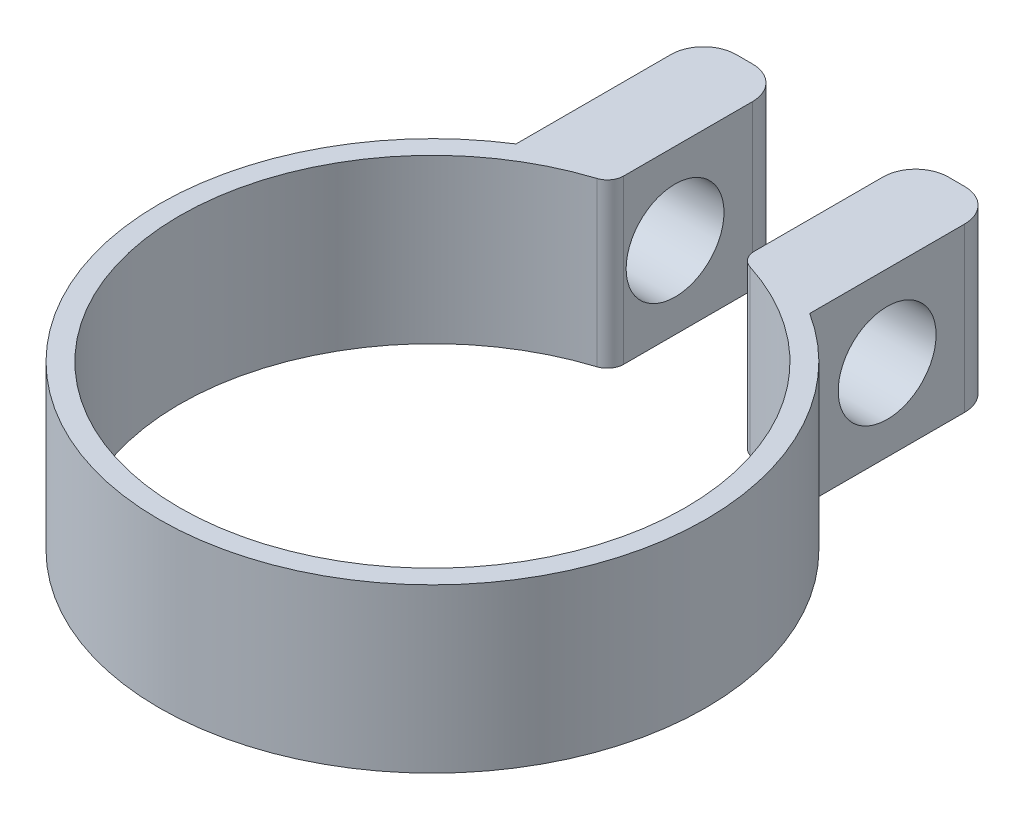
ISO-10303-21;
HEADER;
FILE_DESCRIPTION(('STEP AP214'),'2;1');
FILE_NAME('part.step','',(''),(''),'','','');
FILE_SCHEMA(('AUTOMOTIVE_DESIGN { 1 0 10303 214 1 1 1 1 }'));
ENDSEC;
DATA;
#1=APPLICATION_CONTEXT('core data for automotive mechanical design processes');
#2=APPLICATION_PROTOCOL_DEFINITION('international standard','automotive_design',2000,#1);
#3=PRODUCT_CONTEXT('',#1,'mechanical');
#4=PRODUCT('Part','Part','',(#3));
#5=PRODUCT_RELATED_PRODUCT_CATEGORY('part','',(#4));
#6=PRODUCT_DEFINITION_FORMATION('','',#4);
#7=PRODUCT_DEFINITION_CONTEXT('part definition',#1,'design');
#8=PRODUCT_DEFINITION('design','',#6,#7);
#9=PRODUCT_DEFINITION_SHAPE('','',#8);
#10=(LENGTH_UNIT() NAMED_UNIT(*) SI_UNIT(.MILLI.,.METRE.));
#11=(NAMED_UNIT(*) PLANE_ANGLE_UNIT() SI_UNIT($,.RADIAN.));
#12=(NAMED_UNIT(*) SI_UNIT($,.STERADIAN.) SOLID_ANGLE_UNIT());
#13=UNCERTAINTY_MEASURE_WITH_UNIT(LENGTH_MEASURE(1.E-05),#10,'distance_accuracy_value','');
#14=(GEOMETRIC_REPRESENTATION_CONTEXT(3) GLOBAL_UNCERTAINTY_ASSIGNED_CONTEXT((#13)) GLOBAL_UNIT_ASSIGNED_CONTEXT((#10,
#11,#12)) REPRESENTATION_CONTEXT('',''));
#15=CARTESIAN_POINT('',(0.,0.,0.));
#16=DIRECTION('',(0.,0.,1.));
#17=DIRECTION('',(1.,0.,0.));
#18=AXIS2_PLACEMENT_3D('',#15,#16,#17);
#19=CARTESIAN_POINT('',(0.,10.,0.));
#20=DIRECTION('',(0.,-1.,0.));
#21=DIRECTION('',(0.,0.,-1.));
#22=AXIS2_PLACEMENT_3D('',#19,#20,#21);
#23=CYLINDRICAL_SURFACE('',#22,16.75);
#24=CARTESIAN_POINT('',(0.,0.,0.));
#25=DIRECTION('',(0.,1.,0.));
#26=DIRECTION('',(0.,0.,1.));
#27=AXIS2_PLACEMENT_3D('',#24,#25,#26);
#28=CIRCLE('',#27,16.75);
#29=CARTESIAN_POINT('',(-9.,0.,-14.1266591945867));
#30=VERTEX_POINT('',#29);
#31=CARTESIAN_POINT('',(9.,0.,-14.1266591945867));
#32=VERTEX_POINT('',#31);
#33=EDGE_CURVE('E162',#30,#32,#28,.T.);
#34=ORIENTED_EDGE('',*,*,#33,.T.);
#35=DIRECTION('',(0.,-1.,0.));
#36=VECTOR('',#35,1.);
#37=CARTESIAN_POINT('',(9.,10.,-14.1266591945867));
#38=LINE('',#37,#36);
#39=CARTESIAN_POINT('',(9.,10.,-14.1266591945867));
#40=VERTEX_POINT('',#39);
#41=EDGE_CURVE('E145',#40,#32,#38,.T.);
#42=ORIENTED_EDGE('',*,*,#41,.F.);
#43=CARTESIAN_POINT('',(0.,10.,0.));
#44=DIRECTION('',(0.,1.,0.));
#45=DIRECTION('',(0.,0.,1.));
#46=AXIS2_PLACEMENT_3D('',#43,#44,#45);
#47=CIRCLE('',#46,16.75);
#48=CARTESIAN_POINT('',(-9.,10.,-14.1266591945867));
#49=VERTEX_POINT('',#48);
#50=EDGE_CURVE('E151',#49,#40,#47,.T.);
#51=ORIENTED_EDGE('',*,*,#50,.F.);
#52=DIRECTION('',(0.,-1.,0.));
#53=VECTOR('',#52,1.);
#54=CARTESIAN_POINT('',(-9.,10.,-14.1266591945867));
#55=LINE('',#54,#53);
#56=EDGE_CURVE('E164',#49,#30,#55,.T.);
#57=ORIENTED_EDGE('',*,*,#56,.T.);
#58=EDGE_LOOP('',(#34,#42,#51,#57));
#59=FACE_BOUND('',#58,.T.);
#60=ADVANCED_FACE('F36',(#59),#23,.T.);
#61=CARTESIAN_POINT('',(9.,10.,-14.1266591945867));
#62=DIRECTION('',(-1.,0.,0.));
#63=DIRECTION('',(0.,0.,1.));
#64=AXIS2_PLACEMENT_3D('',#61,#62,#63);
#65=PLANE('',#64);
#66=CARTESIAN_POINT('',(9.,5.,-18.8730443293553));
#67=DIRECTION('',(1.,0.,0.));
#68=DIRECTION('',(0.,0.,-1.));
#69=AXIS2_PLACEMENT_3D('',#66,#67,#68);
#70=CIRCLE('',#69,3.);
#71=CARTESIAN_POINT('',(9.,5.,-21.8730443293553));
#72=VERTEX_POINT('',#71);
#73=EDGE_CURVE('E269',#72,#72,#70,.T.);
#74=ORIENTED_EDGE('',*,*,#73,.F.);
#75=EDGE_LOOP('',(#74));
#76=FACE_BOUND('',#75,.T.);
#77=DIRECTION('',(0.,0.,-1.));
#78=VECTOR('',#77,1.);
#79=CARTESIAN_POINT('',(9.,0.,-14.1266591945867));
#80=LINE('',#79,#78);
#81=CARTESIAN_POINT('',(9.,0.,-23.619429464124));
#82=VERTEX_POINT('',#81);
#83=EDGE_CURVE('E253',#32,#82,#80,.T.);
#84=ORIENTED_EDGE('',*,*,#83,.T.);
#85=DIRECTION('',(0.,-1.,0.));
#86=VECTOR('',#85,1.);
#87=CARTESIAN_POINT('',(9.,10.,-23.619429464124));
#88=LINE('',#87,#86);
#89=CARTESIAN_POINT('',(9.,10.,-23.619429464124));
#90=VERTEX_POINT('',#89);
#91=EDGE_CURVE('E148',#82,#90,#88,.F.);
#92=ORIENTED_EDGE('',*,*,#91,.T.);
#93=DIRECTION('',(0.,0.,-1.));
#94=VECTOR('',#93,1.);
#95=CARTESIAN_POINT('',(9.,10.,-14.1266591945867));
#96=LINE('',#95,#94);
#97=EDGE_CURVE('E140',#40,#90,#96,.T.);
#98=ORIENTED_EDGE('',*,*,#97,.F.);
#99=ORIENTED_EDGE('',*,*,#41,.T.);
#100=EDGE_LOOP('',(#84,#92,#98,#99));
#101=FACE_BOUND('',#100,.T.);
#102=ADVANCED_FACE('F143',(#76,#101),#65,.F.);
#103=CARTESIAN_POINT('',(9.,10.,-25.619429464124));
#104=DIRECTION('',(0.,0.,1.));
#105=DIRECTION('',(1.,0.,0.));
#106=AXIS2_PLACEMENT_3D('',#103,#104,#105);
#107=PLANE('',#106);
#108=DIRECTION('',(-1.,0.,0.));
#109=VECTOR('',#108,1.);
#110=CARTESIAN_POINT('',(9.,10.,-25.619429464124));
#111=LINE('',#110,#109);
#112=CARTESIAN_POINT('',(7.,10.,-25.619429464124));
#113=VERTEX_POINT('',#112);
#114=CARTESIAN_POINT('',(6.,10.,-25.619429464124));
#115=VERTEX_POINT('',#114);
#116=EDGE_CURVE('E150',#113,#115,#111,.T.);
#117=ORIENTED_EDGE('',*,*,#116,.F.);
#118=DIRECTION('',(0.,-1.,0.));
#119=VECTOR('',#118,1.);
#120=CARTESIAN_POINT('',(7.,10.,-25.619429464124));
#121=LINE('',#120,#119);
#122=CARTESIAN_POINT('',(7.,0.,-25.619429464124));
#123=VERTEX_POINT('',#122);
#124=EDGE_CURVE('E190',#113,#123,#121,.T.);
#125=ORIENTED_EDGE('',*,*,#124,.T.);
#126=DIRECTION('',(-1.,0.,0.));
#127=VECTOR('',#126,1.);
#128=CARTESIAN_POINT('',(9.,0.,-25.619429464124));
#129=LINE('',#128,#127);
#130=CARTESIAN_POINT('',(6.,0.,-25.619429464124));
#131=VERTEX_POINT('',#130);
#132=EDGE_CURVE('E250',#123,#131,#129,.T.);
#133=ORIENTED_EDGE('',*,*,#132,.T.);
#134=DIRECTION('',(0.,-1.,0.));
#135=VECTOR('',#134,1.);
#136=CARTESIAN_POINT('',(6.,10.,-25.619429464124));
#137=LINE('',#136,#135);
#138=EDGE_CURVE('E188',#131,#115,#137,.F.);
#139=ORIENTED_EDGE('',*,*,#138,.T.);
#140=EDGE_LOOP('',(#117,#125,#133,#139));
#141=FACE_BOUND('',#140,.T.);
#142=ADVANCED_FACE('F302',(#141),#107,.F.);
#143=CARTESIAN_POINT('',(4.,10.,-14.9749791318719));
#144=DIRECTION('',(1.,0.,0.));
#145=DIRECTION('',(0.,0.,-1.));
#146=AXIS2_PLACEMENT_3D('',#143,#144,#145);
#147=PLANE('',#146);
#148=CARTESIAN_POINT('',(4.,5.,-18.8730443293553));
#149=DIRECTION('',(1.,0.,0.));
#150=DIRECTION('',(0.,0.,-1.));
#151=AXIS2_PLACEMENT_3D('',#148,#149,#150);
#152=CIRCLE('',#151,3.);
#153=CARTESIAN_POINT('',(4.,5.,-21.8730443293553));
#154=VERTEX_POINT('',#153);
#155=EDGE_CURVE('E256',#154,#154,#152,.T.);
#156=ORIENTED_EDGE('',*,*,#155,.T.);
#157=EDGE_LOOP('',(#156));
#158=FACE_BOUND('',#157,.T.);
#159=DIRECTION('',(0.,0.,1.));
#160=VECTOR('',#159,1.);
#161=CARTESIAN_POINT('',(4.,10.,-14.9749791318719));
#162=LINE('',#161,#160);
#163=CARTESIAN_POINT('',(4.,10.,-23.619429464124));
#164=VERTEX_POINT('',#163);
#165=CARTESIAN_POINT('',(4.,10.,-15.7241851935164));
#166=VERTEX_POINT('',#165);
#167=EDGE_CURVE('E260',#164,#166,#162,.T.);
#168=ORIENTED_EDGE('',*,*,#167,.F.);
#169=DIRECTION('',(0.,-1.,0.));
#170=VECTOR('',#169,1.);
#171=CARTESIAN_POINT('',(4.,10.,-23.619429464124));
#172=LINE('',#171,#170);
#173=CARTESIAN_POINT('',(4.,0.,-23.619429464124));
#174=VERTEX_POINT('',#173);
#175=EDGE_CURVE('E209',#164,#174,#172,.T.);
#176=ORIENTED_EDGE('',*,*,#175,.T.);
#177=DIRECTION('',(0.,0.,1.));
#178=VECTOR('',#177,1.);
#179=CARTESIAN_POINT('',(4.,0.,-14.9749791318719));
#180=LINE('',#179,#178);
#181=CARTESIAN_POINT('',(4.,0.,-15.7241851935164));
#182=VERTEX_POINT('',#181);
#183=EDGE_CURVE('E248',#174,#182,#180,.T.);
#184=ORIENTED_EDGE('',*,*,#183,.T.);
#185=DIRECTION('',(0.,-1.,0.));
#186=VECTOR('',#185,1.);
#187=CARTESIAN_POINT('',(4.,10.,-15.7241851935164));
#188=LINE('',#187,#186);
#189=EDGE_CURVE('E178',#182,#166,#188,.F.);
#190=ORIENTED_EDGE('',*,*,#189,.T.);
#191=EDGE_LOOP('',(#168,#176,#184,#190));
#192=FACE_BOUND('',#191,.T.);
#193=ADVANCED_FACE('F294',(#158,#192),#147,.F.);
#194=CARTESIAN_POINT('',(0.,10.,0.));
#195=DIRECTION('',(0.,-1.,0.));
#196=DIRECTION('',(0.,0.,-1.));
#197=AXIS2_PLACEMENT_3D('',#194,#195,#196);
#198=CYLINDRICAL_SURFACE('',#197,15.5);
#199=CARTESIAN_POINT('',(0.,10.,0.));
#200=DIRECTION('',(0.,-1.,0.));
#201=DIRECTION('',(0.,0.,1.));
#202=AXIS2_PLACEMENT_3D('',#199,#200,#201);
#203=CIRCLE('',#202,15.5);
#204=CARTESIAN_POINT('',(4.6969696969697,10.,-14.7712042726972));
#205=VERTEX_POINT('',#204);
#206=CARTESIAN_POINT('',(-4.6969696969697,10.,-14.7712042726972));
#207=VERTEX_POINT('',#206);
#208=EDGE_CURVE('E231',#205,#207,#203,.T.);
#209=ORIENTED_EDGE('',*,*,#208,.F.);
#210=DIRECTION('',(0.,-1.,0.));
#211=VECTOR('',#210,1.);
#212=CARTESIAN_POINT('',(4.6969696969697,10.,-14.7712042726972));
#213=LINE('',#212,#211);
#214=CARTESIAN_POINT('',(4.6969696969697,0.,-14.7712042726972));
#215=VERTEX_POINT('',#214);
#216=EDGE_CURVE('E166',#205,#215,#213,.T.);
#217=ORIENTED_EDGE('',*,*,#216,.T.);
#218=CARTESIAN_POINT('',(0.,0.,0.));
#219=DIRECTION('',(0.,-1.,0.));
#220=DIRECTION('',(0.,0.,1.));
#221=AXIS2_PLACEMENT_3D('',#218,#219,#220);
#222=CIRCLE('',#221,15.5);
#223=CARTESIAN_POINT('',(-4.6969696969697,0.,-14.7712042726972));
#224=VERTEX_POINT('',#223);
#225=EDGE_CURVE('E243',#215,#224,#222,.T.);
#226=ORIENTED_EDGE('',*,*,#225,.T.);
#227=DIRECTION('',(0.,-1.,0.));
#228=VECTOR('',#227,1.);
#229=CARTESIAN_POINT('',(-4.69696969696969,10.,-14.7712042726972));
#230=LINE('',#229,#228);
#231=EDGE_CURVE('E163',#224,#207,#230,.F.);
#232=ORIENTED_EDGE('',*,*,#231,.T.);
#233=EDGE_LOOP('',(#209,#217,#226,#232));
#234=FACE_BOUND('',#233,.T.);
#235=ADVANCED_FACE('F287',(#234),#198,.F.);
#236=CARTESIAN_POINT('',(-4.,10.,-14.9749791318719));
#237=DIRECTION('',(-1.,0.,0.));
#238=DIRECTION('',(0.,0.,1.));
#239=AXIS2_PLACEMENT_3D('',#236,#237,#238);
#240=PLANE('',#239);
#241=CARTESIAN_POINT('',(-4.,5.,-18.8730443293553));
#242=DIRECTION('',(-1.,0.,0.));
#243=DIRECTION('',(0.,0.,1.));
#244=AXIS2_PLACEMENT_3D('',#241,#242,#243);
#245=CIRCLE('',#244,3.);
#246=CARTESIAN_POINT('',(-4.,5.,-15.8730443293553));
#247=VERTEX_POINT('',#246);
#248=EDGE_CURVE('E266',#247,#247,#245,.T.);
#249=ORIENTED_EDGE('',*,*,#248,.T.);
#250=EDGE_LOOP('',(#249));
#251=FACE_BOUND('',#250,.T.);
#252=DIRECTION('',(0.,0.,-1.));
#253=VECTOR('',#252,1.);
#254=CARTESIAN_POINT('',(-4.,0.,-14.9749791318719));
#255=LINE('',#254,#253);
#256=CARTESIAN_POINT('',(-4.,0.,-15.7241851935164));
#257=VERTEX_POINT('',#256);
#258=CARTESIAN_POINT('',(-4.,0.,-23.619429464124));
#259=VERTEX_POINT('',#258);
#260=EDGE_CURVE('E225',#257,#259,#255,.T.);
#261=ORIENTED_EDGE('',*,*,#260,.T.);
#262=DIRECTION('',(0.,-1.,0.));
#263=VECTOR('',#262,1.);
#264=CARTESIAN_POINT('',(-4.,10.,-23.619429464124));
#265=LINE('',#264,#263);
#266=CARTESIAN_POINT('',(-4.,10.,-23.619429464124));
#267=VERTEX_POINT('',#266);
#268=EDGE_CURVE('E45',#259,#267,#265,.F.);
#269=ORIENTED_EDGE('',*,*,#268,.T.);
#270=DIRECTION('',(0.,0.,-1.));
#271=VECTOR('',#270,1.);
#272=CARTESIAN_POINT('',(-4.,10.,-14.9749791318719));
#273=LINE('',#272,#271);
#274=CARTESIAN_POINT('',(-4.,10.,-15.7241851935164));
#275=VERTEX_POINT('',#274);
#276=EDGE_CURVE('E222',#275,#267,#273,.T.);
#277=ORIENTED_EDGE('',*,*,#276,.F.);
#278=DIRECTION('',(0.,-1.,0.));
#279=VECTOR('',#278,1.);
#280=CARTESIAN_POINT('',(-4.,10.,-15.7241851935164));
#281=LINE('',#280,#279);
#282=EDGE_CURVE('E185',#275,#257,#281,.T.);
#283=ORIENTED_EDGE('',*,*,#282,.T.);
#284=EDGE_LOOP('',(#261,#269,#277,#283));
#285=FACE_BOUND('',#284,.T.);
#286=ADVANCED_FACE('F221',(#251,#285),#240,.F.);
#287=CARTESIAN_POINT('',(-9.,10.,-25.619429464124));
#288=DIRECTION('',(0.,0.,1.));
#289=DIRECTION('',(1.,0.,0.));
#290=AXIS2_PLACEMENT_3D('',#287,#288,#289);
#291=PLANE('',#290);
#292=DIRECTION('',(-1.,0.,0.));
#293=VECTOR('',#292,1.);
#294=CARTESIAN_POINT('',(-9.,10.,-25.619429464124));
#295=LINE('',#294,#293);
#296=CARTESIAN_POINT('',(-6.,10.,-25.619429464124));
#297=VERTEX_POINT('',#296);
#298=CARTESIAN_POINT('',(-7.,10.,-25.619429464124));
#299=VERTEX_POINT('',#298);
#300=EDGE_CURVE('E230',#297,#299,#295,.T.);
#301=ORIENTED_EDGE('',*,*,#300,.F.);
#302=DIRECTION('',(0.,-1.,0.));
#303=VECTOR('',#302,1.);
#304=CARTESIAN_POINT('',(-6.,10.,-25.619429464124));
#305=LINE('',#304,#303);
#306=CARTESIAN_POINT('',(-6.,0.,-25.619429464124));
#307=VERTEX_POINT('',#306);
#308=EDGE_CURVE('E213',#297,#307,#305,.T.);
#309=ORIENTED_EDGE('',*,*,#308,.T.);
#310=DIRECTION('',(-1.,0.,0.));
#311=VECTOR('',#310,1.);
#312=CARTESIAN_POINT('',(-9.,0.,-25.619429464124));
#313=LINE('',#312,#311);
#314=CARTESIAN_POINT('',(-7.,0.,-25.619429464124));
#315=VERTEX_POINT('',#314);
#316=EDGE_CURVE('E237',#307,#315,#313,.T.);
#317=ORIENTED_EDGE('',*,*,#316,.T.);
#318=DIRECTION('',(0.,-1.,0.));
#319=VECTOR('',#318,1.);
#320=CARTESIAN_POINT('',(-7.,10.,-25.619429464124));
#321=LINE('',#320,#319);
#322=EDGE_CURVE('E60',#315,#299,#321,.F.);
#323=ORIENTED_EDGE('',*,*,#322,.T.);
#324=EDGE_LOOP('',(#301,#309,#317,#323));
#325=FACE_BOUND('',#324,.T.);
#326=ADVANCED_FACE('F236',(#325),#291,.F.);
#327=CARTESIAN_POINT('',(-9.,10.,-14.1266591945867));
#328=DIRECTION('',(1.,0.,0.));
#329=DIRECTION('',(0.,0.,-1.));
#330=AXIS2_PLACEMENT_3D('',#327,#328,#329);
#331=PLANE('',#330);
#332=CARTESIAN_POINT('',(-9.,5.,-18.8730443293553));
#333=DIRECTION('',(1.,0.,0.));
#334=DIRECTION('',(0.,0.,-1.));
#335=AXIS2_PLACEMENT_3D('',#332,#333,#334);
#336=CIRCLE('',#335,3.);
#337=CARTESIAN_POINT('',(-9.,5.,-21.8730443293553));
#338=VERTEX_POINT('',#337);
#339=EDGE_CURVE('E40',#338,#338,#336,.T.);
#340=ORIENTED_EDGE('',*,*,#339,.T.);
#341=EDGE_LOOP('',(#340));
#342=FACE_BOUND('',#341,.T.);
#343=DIRECTION('',(0.,0.,1.));
#344=VECTOR('',#343,1.);
#345=CARTESIAN_POINT('',(-9.,10.,-14.1266591945867));
#346=LINE('',#345,#344);
#347=CARTESIAN_POINT('',(-9.,10.,-23.619429464124));
#348=VERTEX_POINT('',#347);
#349=EDGE_CURVE('E155',#348,#49,#346,.T.);
#350=ORIENTED_EDGE('',*,*,#349,.F.);
#351=DIRECTION('',(0.,-1.,0.));
#352=VECTOR('',#351,1.);
#353=CARTESIAN_POINT('',(-9.,10.,-23.619429464124));
#354=LINE('',#353,#352);
#355=CARTESIAN_POINT('',(-9.,0.,-23.619429464124));
#356=VERTEX_POINT('',#355);
#357=EDGE_CURVE('E11',#348,#356,#354,.T.);
#358=ORIENTED_EDGE('',*,*,#357,.T.);
#359=DIRECTION('',(0.,0.,1.));
#360=VECTOR('',#359,1.);
#361=CARTESIAN_POINT('',(-9.,0.,-14.1266591945867));
#362=LINE('',#361,#360);
#363=EDGE_CURVE('E159',#356,#30,#362,.T.);
#364=ORIENTED_EDGE('',*,*,#363,.T.);
#365=ORIENTED_EDGE('',*,*,#56,.F.);
#366=EDGE_LOOP('',(#350,#358,#364,#365));
#367=FACE_BOUND('',#366,.T.);
#368=ADVANCED_FACE('F276',(#342,#367),#331,.F.);
#369=CARTESIAN_POINT('',(0.,10.,0.));
#370=DIRECTION('',(0.,1.,0.));
#371=DIRECTION('',(0.,0.,1.));
#372=AXIS2_PLACEMENT_3D('',#369,#370,#371);
#373=PLANE('',#372);
#374=ORIENTED_EDGE('',*,*,#97,.T.);
#375=CARTESIAN_POINT('',(7.,10.,-23.619429464124));
#376=DIRECTION('',(0.,1.,0.));
#377=DIRECTION('',(0.,0.,1.));
#378=AXIS2_PLACEMENT_3D('',#375,#376,#377);
#379=CIRCLE('',#378,2.);
#380=EDGE_CURVE('E207',#90,#113,#379,.T.);
#381=ORIENTED_EDGE('',*,*,#380,.T.);
#382=ORIENTED_EDGE('',*,*,#116,.T.);
#383=CARTESIAN_POINT('',(6.,10.,-23.619429464124));
#384=DIRECTION('',(0.,1.,0.));
#385=DIRECTION('',(0.,0.,1.));
#386=AXIS2_PLACEMENT_3D('',#383,#384,#385);
#387=CIRCLE('',#386,2.);
#388=EDGE_CURVE('E205',#115,#164,#387,.T.);
#389=ORIENTED_EDGE('',*,*,#388,.T.);
#390=ORIENTED_EDGE('',*,*,#167,.T.);
#391=CARTESIAN_POINT('',(5.,10.,-15.7241851935164));
#392=DIRECTION('',(0.,1.,0.));
#393=DIRECTION('',(0.,0.,1.));
#394=AXIS2_PLACEMENT_3D('',#391,#392,#393);
#395=CIRCLE('',#394,1.);
#396=EDGE_CURVE('E183',#166,#205,#395,.T.);
#397=ORIENTED_EDGE('',*,*,#396,.T.);
#398=ORIENTED_EDGE('',*,*,#208,.T.);
#399=CARTESIAN_POINT('',(-5.,10.,-15.7241851935164));
#400=DIRECTION('',(0.,1.,0.));
#401=DIRECTION('',(0.,0.,1.));
#402=AXIS2_PLACEMENT_3D('',#399,#400,#401);
#403=CIRCLE('',#402,1.);
#404=EDGE_CURVE('E181',#207,#275,#403,.T.);
#405=ORIENTED_EDGE('',*,*,#404,.T.);
#406=ORIENTED_EDGE('',*,*,#276,.T.);
#407=CARTESIAN_POINT('',(-6.,10.,-23.619429464124));
#408=DIRECTION('',(0.,1.,0.));
#409=DIRECTION('',(0.,0.,1.));
#410=AXIS2_PLACEMENT_3D('',#407,#408,#409);
#411=CIRCLE('',#410,2.);
#412=EDGE_CURVE('E203',#267,#297,#411,.T.);
#413=ORIENTED_EDGE('',*,*,#412,.T.);
#414=ORIENTED_EDGE('',*,*,#300,.T.);
#415=CARTESIAN_POINT('',(-7.,10.,-23.619429464124));
#416=DIRECTION('',(0.,1.,0.));
#417=DIRECTION('',(0.,0.,1.));
#418=AXIS2_PLACEMENT_3D('',#415,#416,#417);
#419=CIRCLE('',#418,2.);
#420=EDGE_CURVE('E52',#299,#348,#419,.T.);
#421=ORIENTED_EDGE('',*,*,#420,.T.);
#422=ORIENTED_EDGE('',*,*,#349,.T.);
#423=ORIENTED_EDGE('',*,*,#50,.T.);
#424=EDGE_LOOP('',(#374,#381,#382,#389,#390,#397,#398,#405,#406,#413,#414,#421,#422,#423));
#425=FACE_BOUND('',#424,.T.);
#426=ADVANCED_FACE('F154',(#425),#373,.T.);
#427=CARTESIAN_POINT('',(0.,0.,0.));
#428=DIRECTION('',(0.,1.,0.));
#429=DIRECTION('',(0.,0.,1.));
#430=AXIS2_PLACEMENT_3D('',#427,#428,#429);
#431=PLANE('',#430);
#432=ORIENTED_EDGE('',*,*,#132,.F.);
#433=CARTESIAN_POINT('',(7.,0.,-23.619429464124));
#434=DIRECTION('',(0.,1.,0.));
#435=DIRECTION('',(0.,0.,1.));
#436=AXIS2_PLACEMENT_3D('',#433,#434,#435);
#437=CIRCLE('',#436,2.);
#438=EDGE_CURVE('E199',#123,#82,#437,.F.);
#439=ORIENTED_EDGE('',*,*,#438,.T.);
#440=ORIENTED_EDGE('',*,*,#83,.F.);
#441=ORIENTED_EDGE('',*,*,#33,.F.);
#442=ORIENTED_EDGE('',*,*,#363,.F.);
#443=CARTESIAN_POINT('',(-7.,0.,-23.619429464124));
#444=DIRECTION('',(0.,1.,0.));
#445=DIRECTION('',(0.,0.,1.));
#446=AXIS2_PLACEMENT_3D('',#443,#444,#445);
#447=CIRCLE('',#446,2.);
#448=EDGE_CURVE('E193',#356,#315,#447,.F.);
#449=ORIENTED_EDGE('',*,*,#448,.T.);
#450=ORIENTED_EDGE('',*,*,#316,.F.);
#451=CARTESIAN_POINT('',(-6.,0.,-23.619429464124));
#452=DIRECTION('',(0.,1.,0.));
#453=DIRECTION('',(0.,0.,1.));
#454=AXIS2_PLACEMENT_3D('',#451,#452,#453);
#455=CIRCLE('',#454,2.);
#456=EDGE_CURVE('E195',#307,#259,#455,.F.);
#457=ORIENTED_EDGE('',*,*,#456,.T.);
#458=ORIENTED_EDGE('',*,*,#260,.F.);
#459=CARTESIAN_POINT('',(-5.,0.,-15.7241851935164));
#460=DIRECTION('',(0.,1.,0.));
#461=DIRECTION('',(0.,0.,1.));
#462=AXIS2_PLACEMENT_3D('',#459,#460,#461);
#463=CIRCLE('',#462,1.);
#464=EDGE_CURVE('E173',#257,#224,#463,.F.);
#465=ORIENTED_EDGE('',*,*,#464,.T.);
#466=ORIENTED_EDGE('',*,*,#225,.F.);
#467=CARTESIAN_POINT('',(5.,0.,-15.7241851935164));
#468=DIRECTION('',(0.,1.,0.));
#469=DIRECTION('',(0.,0.,1.));
#470=AXIS2_PLACEMENT_3D('',#467,#468,#469);
#471=CIRCLE('',#470,1.);
#472=EDGE_CURVE('E175',#215,#182,#471,.F.);
#473=ORIENTED_EDGE('',*,*,#472,.T.);
#474=ORIENTED_EDGE('',*,*,#183,.F.);
#475=CARTESIAN_POINT('',(6.,0.,-23.619429464124));
#476=DIRECTION('',(0.,1.,0.));
#477=DIRECTION('',(0.,0.,1.));
#478=AXIS2_PLACEMENT_3D('',#475,#476,#477);
#479=CIRCLE('',#478,2.);
#480=EDGE_CURVE('E197',#174,#131,#479,.F.);
#481=ORIENTED_EDGE('',*,*,#480,.T.);
#482=EDGE_LOOP('',(#432,#439,#440,#441,#442,#449,#450,#457,#458,#465,#466,#473,#474,#481));
#483=FACE_BOUND('',#482,.T.);
#484=ADVANCED_FACE('F240',(#483),#431,.F.);
#485=CARTESIAN_POINT('',(5.,10.,-15.7241851935164));
#486=DIRECTION('',(0.,-1.,0.));
#487=DIRECTION('',(0.,0.,-1.));
#488=AXIS2_PLACEMENT_3D('',#485,#486,#487);
#489=CYLINDRICAL_SURFACE('',#488,1.);
#490=ORIENTED_EDGE('',*,*,#396,.F.);
#491=ORIENTED_EDGE('',*,*,#189,.F.);
#492=ORIENTED_EDGE('',*,*,#472,.F.);
#493=ORIENTED_EDGE('',*,*,#216,.F.);
#494=EDGE_LOOP('',(#490,#491,#492,#493));
#495=FACE_BOUND('',#494,.T.);
#496=ADVANCED_FACE('F307',(#495),#489,.T.);
#497=CARTESIAN_POINT('',(-5.,10.,-15.7241851935164));
#498=DIRECTION('',(0.,-1.,0.));
#499=DIRECTION('',(0.,0.,-1.));
#500=AXIS2_PLACEMENT_3D('',#497,#498,#499);
#501=CYLINDRICAL_SURFACE('',#500,1.);
#502=ORIENTED_EDGE('',*,*,#404,.F.);
#503=ORIENTED_EDGE('',*,*,#231,.F.);
#504=ORIENTED_EDGE('',*,*,#464,.F.);
#505=ORIENTED_EDGE('',*,*,#282,.F.);
#506=EDGE_LOOP('',(#502,#503,#504,#505));
#507=FACE_BOUND('',#506,.T.);
#508=ADVANCED_FACE('F310',(#507),#501,.T.);
#509=CARTESIAN_POINT('',(7.,10.,-23.619429464124));
#510=DIRECTION('',(0.,-1.,0.));
#511=DIRECTION('',(0.,0.,-1.));
#512=AXIS2_PLACEMENT_3D('',#509,#510,#511);
#513=CYLINDRICAL_SURFACE('',#512,2.);
#514=ORIENTED_EDGE('',*,*,#380,.F.);
#515=ORIENTED_EDGE('',*,*,#91,.F.);
#516=ORIENTED_EDGE('',*,*,#438,.F.);
#517=ORIENTED_EDGE('',*,*,#124,.F.);
#518=EDGE_LOOP('',(#514,#515,#516,#517));
#519=FACE_BOUND('',#518,.T.);
#520=ADVANCED_FACE('F314',(#519),#513,.T.);
#521=CARTESIAN_POINT('',(6.,10.,-23.619429464124));
#522=DIRECTION('',(0.,-1.,0.));
#523=DIRECTION('',(0.,0.,-1.));
#524=AXIS2_PLACEMENT_3D('',#521,#522,#523);
#525=CYLINDRICAL_SURFACE('',#524,2.);
#526=ORIENTED_EDGE('',*,*,#388,.F.);
#527=ORIENTED_EDGE('',*,*,#138,.F.);
#528=ORIENTED_EDGE('',*,*,#480,.F.);
#529=ORIENTED_EDGE('',*,*,#175,.F.);
#530=EDGE_LOOP('',(#526,#527,#528,#529));
#531=FACE_BOUND('',#530,.T.);
#532=ADVANCED_FACE('F318',(#531),#525,.T.);
#533=CARTESIAN_POINT('',(-6.,10.,-23.619429464124));
#534=DIRECTION('',(0.,-1.,0.));
#535=DIRECTION('',(0.,0.,-1.));
#536=AXIS2_PLACEMENT_3D('',#533,#534,#535);
#537=CYLINDRICAL_SURFACE('',#536,2.);
#538=ORIENTED_EDGE('',*,*,#412,.F.);
#539=ORIENTED_EDGE('',*,*,#268,.F.);
#540=ORIENTED_EDGE('',*,*,#456,.F.);
#541=ORIENTED_EDGE('',*,*,#308,.F.);
#542=EDGE_LOOP('',(#538,#539,#540,#541));
#543=FACE_BOUND('',#542,.T.);
#544=ADVANCED_FACE('F234',(#543),#537,.T.);
#545=CARTESIAN_POINT('',(-7.,10.,-23.619429464124));
#546=DIRECTION('',(0.,-1.,0.));
#547=DIRECTION('',(0.,0.,-1.));
#548=AXIS2_PLACEMENT_3D('',#545,#546,#547);
#549=CYLINDRICAL_SURFACE('',#548,2.);
#550=ORIENTED_EDGE('',*,*,#420,.F.);
#551=ORIENTED_EDGE('',*,*,#322,.F.);
#552=ORIENTED_EDGE('',*,*,#448,.F.);
#553=ORIENTED_EDGE('',*,*,#357,.F.);
#554=EDGE_LOOP('',(#550,#551,#552,#553));
#555=FACE_BOUND('',#554,.T.);
#556=ADVANCED_FACE('F38',(#555),#549,.T.);
#557=CARTESIAN_POINT('',(-16.75,5.,-18.8730443293553));
#558=DIRECTION('',(1.,0.,0.));
#559=DIRECTION('',(0.,0.,-1.));
#560=AXIS2_PLACEMENT_3D('',#557,#558,#559);
#561=CYLINDRICAL_SURFACE('',#560,3.);
#562=ORIENTED_EDGE('',*,*,#339,.F.);
#563=EDGE_LOOP('',(#562));
#564=FACE_BOUND('',#563,.T.);
#565=ORIENTED_EDGE('',*,*,#248,.F.);
#566=EDGE_LOOP('',(#565));
#567=FACE_BOUND('',#566,.T.);
#568=ADVANCED_FACE('F279',(#564,#567),#561,.F.);
#569=ORIENTED_EDGE('',*,*,#73,.T.);
#570=EDGE_LOOP('',(#569));
#571=FACE_BOUND('',#570,.T.);
#572=ORIENTED_EDGE('',*,*,#155,.F.);
#573=EDGE_LOOP('',(#572));
#574=FACE_BOUND('',#573,.T.);
#575=ADVANCED_FACE('F282',(#571,#574),#561,.F.);
#576=CLOSED_SHELL('',(#60,#102,#142,#193,#235,#286,#326,#368,#426,#484,#496,#508,#520,#532,#544,
#556,#568,#575));
#577=MANIFOLD_SOLID_BREP('B2',#576);
#578=ADVANCED_BREP_SHAPE_REPRESENTATION('',(#18,#577),#14);
#579=SHAPE_DEFINITION_REPRESENTATION(#9,#578);
ENDSEC;
END-ISO-10303-21;
